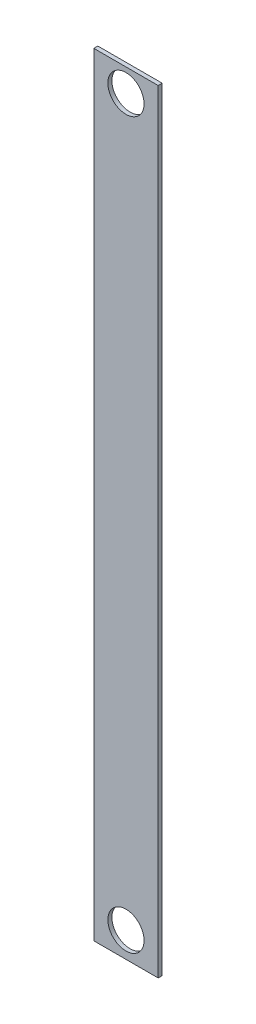
ISO-10303-21;
HEADER;
FILE_DESCRIPTION(('STEP AP214'),'2;1');
FILE_NAME('part.step','',(''),(''),'','','');
FILE_SCHEMA(('AUTOMOTIVE_DESIGN { 1 0 10303 214 1 1 1 1 }'));
ENDSEC;
DATA;
#1=APPLICATION_CONTEXT('core data for automotive mechanical design processes');
#2=APPLICATION_PROTOCOL_DEFINITION('international standard','automotive_design',2000,#1);
#3=PRODUCT_CONTEXT('',#1,'mechanical');
#4=PRODUCT('Part','Part','',(#3));
#5=PRODUCT_RELATED_PRODUCT_CATEGORY('part','',(#4));
#6=PRODUCT_DEFINITION_FORMATION('','',#4);
#7=PRODUCT_DEFINITION_CONTEXT('part definition',#1,'design');
#8=PRODUCT_DEFINITION('design','',#6,#7);
#9=PRODUCT_DEFINITION_SHAPE('','',#8);
#10=(LENGTH_UNIT() NAMED_UNIT(*) SI_UNIT(.MILLI.,.METRE.));
#11=(NAMED_UNIT(*) PLANE_ANGLE_UNIT() SI_UNIT($,.RADIAN.));
#12=(NAMED_UNIT(*) SI_UNIT($,.STERADIAN.) SOLID_ANGLE_UNIT());
#13=UNCERTAINTY_MEASURE_WITH_UNIT(LENGTH_MEASURE(1.E-05),#10,'distance_accuracy_value','');
#14=(GEOMETRIC_REPRESENTATION_CONTEXT(3) GLOBAL_UNCERTAINTY_ASSIGNED_CONTEXT((#13)) GLOBAL_UNIT_ASSIGNED_CONTEXT((#10,
#11,#12)) REPRESENTATION_CONTEXT('',''));
#15=CARTESIAN_POINT('',(0.,0.,0.));
#16=DIRECTION('',(0.,0.,1.));
#17=DIRECTION('',(1.,0.,0.));
#18=AXIS2_PLACEMENT_3D('',#15,#16,#17);
#19=CARTESIAN_POINT('',(0.,0.,3.175));
#20=DIRECTION('',(1.,0.,0.));
#21=DIRECTION('',(0.,1.,0.));
#22=AXIS2_PLACEMENT_3D('',#19,#20,#21);
#23=PLANE('',#22);
#24=DIRECTION('',(0.,-1.,0.));
#25=VECTOR('',#24,1.);
#26=CARTESIAN_POINT('',(0.,0.,0.));
#27=LINE('',#26,#25);
#28=CARTESIAN_POINT('',(0.,0.,0.));
#29=VERTEX_POINT('',#28);
#30=CARTESIAN_POINT('',(0.,-609.6,0.));
#31=VERTEX_POINT('',#30);
#32=EDGE_CURVE('E105',#29,#31,#27,.T.);
#33=ORIENTED_EDGE('',*,*,#32,.T.);
#34=DIRECTION('',(0.,0.,-1.));
#35=VECTOR('',#34,1.);
#36=CARTESIAN_POINT('',(0.,-609.6,3.175));
#37=LINE('',#36,#35);
#38=CARTESIAN_POINT('',(0.,-609.6,3.175));
#39=VERTEX_POINT('',#38);
#40=EDGE_CURVE('E11',#39,#31,#37,.T.);
#41=ORIENTED_EDGE('',*,*,#40,.F.);
#42=DIRECTION('',(0.,-1.,0.));
#43=VECTOR('',#42,1.);
#44=CARTESIAN_POINT('',(0.,0.,3.175));
#45=LINE('',#44,#43);
#46=CARTESIAN_POINT('',(0.,0.,3.175));
#47=VERTEX_POINT('',#46);
#48=EDGE_CURVE('E89',#47,#39,#45,.T.);
#49=ORIENTED_EDGE('',*,*,#48,.F.);
#50=DIRECTION('',(0.,0.,-1.));
#51=VECTOR('',#50,1.);
#52=CARTESIAN_POINT('',(0.,0.,3.175));
#53=LINE('',#52,#51);
#54=EDGE_CURVE('E98',#47,#29,#53,.T.);
#55=ORIENTED_EDGE('',*,*,#54,.T.);
#56=EDGE_LOOP('',(#33,#41,#49,#55));
#57=FACE_BOUND('',#56,.T.);
#58=ADVANCED_FACE('F39',(#57),#23,.F.);
#59=CARTESIAN_POINT('',(0.,-609.6,3.175));
#60=DIRECTION('',(0.,1.,0.));
#61=DIRECTION('',(0.,0.,1.));
#62=AXIS2_PLACEMENT_3D('',#59,#60,#61);
#63=PLANE('',#62);
#64=DIRECTION('',(1.,0.,0.));
#65=VECTOR('',#64,1.);
#66=CARTESIAN_POINT('',(0.,-609.6,0.));
#67=LINE('',#66,#65);
#68=CARTESIAN_POINT('',(50.8000000000001,-609.6,0.));
#69=VERTEX_POINT('',#68);
#70=EDGE_CURVE('E94',#31,#69,#67,.T.);
#71=ORIENTED_EDGE('',*,*,#70,.T.);
#72=DIRECTION('',(0.,0.,-1.));
#73=VECTOR('',#72,1.);
#74=CARTESIAN_POINT('',(50.8000000000001,-609.6,3.175));
#75=LINE('',#74,#73);
#76=CARTESIAN_POINT('',(50.8000000000001,-609.6,3.175));
#77=VERTEX_POINT('',#76);
#78=EDGE_CURVE('E50',#77,#69,#75,.T.);
#79=ORIENTED_EDGE('',*,*,#78,.F.);
#80=DIRECTION('',(1.,0.,0.));
#81=VECTOR('',#80,1.);
#82=CARTESIAN_POINT('',(0.,-609.6,3.175));
#83=LINE('',#82,#81);
#84=EDGE_CURVE('E83',#39,#77,#83,.T.);
#85=ORIENTED_EDGE('',*,*,#84,.F.);
#86=ORIENTED_EDGE('',*,*,#40,.T.);
#87=EDGE_LOOP('',(#71,#79,#85,#86));
#88=FACE_BOUND('',#87,.T.);
#89=ADVANCED_FACE('F91',(#88),#63,.F.);
#90=CARTESIAN_POINT('',(50.8,0.,3.175));
#91=DIRECTION('',(-1.,0.,0.));
#92=DIRECTION('',(0.,-1.,0.));
#93=AXIS2_PLACEMENT_3D('',#90,#91,#92);
#94=PLANE('',#93);
#95=DIRECTION('',(0.,1.,0.));
#96=VECTOR('',#95,1.);
#97=CARTESIAN_POINT('',(50.8,0.,0.));
#98=LINE('',#97,#96);
#99=CARTESIAN_POINT('',(50.8,0.,0.));
#100=VERTEX_POINT('',#99);
#101=EDGE_CURVE('E75',#69,#100,#98,.T.);
#102=ORIENTED_EDGE('',*,*,#101,.T.);
#103=DIRECTION('',(0.,0.,-1.));
#104=VECTOR('',#103,1.);
#105=CARTESIAN_POINT('',(50.8,0.,3.175));
#106=LINE('',#105,#104);
#107=CARTESIAN_POINT('',(50.8,0.,3.175));
#108=VERTEX_POINT('',#107);
#109=EDGE_CURVE('E92',#108,#100,#106,.T.);
#110=ORIENTED_EDGE('',*,*,#109,.F.);
#111=DIRECTION('',(0.,1.,0.));
#112=VECTOR('',#111,1.);
#113=CARTESIAN_POINT('',(50.8,0.,3.175));
#114=LINE('',#113,#112);
#115=EDGE_CURVE('E86',#77,#108,#114,.T.);
#116=ORIENTED_EDGE('',*,*,#115,.F.);
#117=ORIENTED_EDGE('',*,*,#78,.T.);
#118=EDGE_LOOP('',(#102,#110,#116,#117));
#119=FACE_BOUND('',#118,.T.);
#120=ADVANCED_FACE('F96',(#119),#94,.F.);
#121=CARTESIAN_POINT('',(0.,0.,3.175));
#122=DIRECTION('',(0.,-1.,0.));
#123=DIRECTION('',(0.,0.,-1.));
#124=AXIS2_PLACEMENT_3D('',#121,#122,#123);
#125=PLANE('',#124);
#126=DIRECTION('',(-1.,0.,0.));
#127=VECTOR('',#126,1.);
#128=CARTESIAN_POINT('',(0.,0.,0.));
#129=LINE('',#128,#127);
#130=EDGE_CURVE('E77',#100,#29,#129,.T.);
#131=ORIENTED_EDGE('',*,*,#130,.T.);
#132=ORIENTED_EDGE('',*,*,#54,.F.);
#133=DIRECTION('',(-1.,0.,0.));
#134=VECTOR('',#133,1.);
#135=CARTESIAN_POINT('',(0.,0.,3.175));
#136=LINE('',#135,#134);
#137=EDGE_CURVE('E54',#108,#47,#136,.T.);
#138=ORIENTED_EDGE('',*,*,#137,.F.);
#139=ORIENTED_EDGE('',*,*,#109,.T.);
#140=EDGE_LOOP('',(#131,#132,#138,#139));
#141=FACE_BOUND('',#140,.T.);
#142=ADVANCED_FACE('F109',(#141),#125,.F.);
#143=CARTESIAN_POINT('',(0.,0.,3.175));
#144=DIRECTION('',(0.,0.,1.));
#145=DIRECTION('',(1.,0.,0.));
#146=AXIS2_PLACEMENT_3D('',#143,#144,#145);
#147=PLANE('',#146);
#148=CARTESIAN_POINT('',(25.4,-18.1413640627852,3.175));
#149=DIRECTION('',(0.,0.,1.));
#150=DIRECTION('',(1.,0.,0.));
#151=AXIS2_PLACEMENT_3D('',#148,#149,#150);
#152=CIRCLE('',#151,14.279);
#153=CARTESIAN_POINT('',(39.679,-18.1413640627852,3.175));
#154=VERTEX_POINT('',#153);
#155=EDGE_CURVE('E124',#154,#154,#152,.T.);
#156=ORIENTED_EDGE('',*,*,#155,.F.);
#157=EDGE_LOOP('',(#156));
#158=FACE_BOUND('',#157,.T.);
#159=CARTESIAN_POINT('',(25.4,-589.6,3.175));
#160=DIRECTION('',(0.,0.,1.));
#161=DIRECTION('',(1.,0.,0.));
#162=AXIS2_PLACEMENT_3D('',#159,#160,#161);
#163=CIRCLE('',#162,14.279);
#164=CARTESIAN_POINT('',(39.679,-589.6,3.175));
#165=VERTEX_POINT('',#164);
#166=EDGE_CURVE('E120',#165,#165,#163,.T.);
#167=ORIENTED_EDGE('',*,*,#166,.F.);
#168=EDGE_LOOP('',(#167));
#169=FACE_BOUND('',#168,.T.);
#170=ORIENTED_EDGE('',*,*,#48,.T.);
#171=ORIENTED_EDGE('',*,*,#84,.T.);
#172=ORIENTED_EDGE('',*,*,#115,.T.);
#173=ORIENTED_EDGE('',*,*,#137,.T.);
#174=EDGE_LOOP('',(#170,#171,#172,#173));
#175=FACE_BOUND('',#174,.T.);
#176=ADVANCED_FACE('F88',(#158,#169,#175),#147,.T.);
#177=CARTESIAN_POINT('',(0.,0.,0.));
#178=DIRECTION('',(0.,0.,1.));
#179=DIRECTION('',(1.,0.,0.));
#180=AXIS2_PLACEMENT_3D('',#177,#178,#179);
#181=PLANE('',#180);
#182=CARTESIAN_POINT('',(25.4,-18.1413640627852,0.));
#183=DIRECTION('',(0.,0.,1.));
#184=DIRECTION('',(1.,0.,0.));
#185=AXIS2_PLACEMENT_3D('',#182,#183,#184);
#186=CIRCLE('',#185,14.279);
#187=CARTESIAN_POINT('',(39.679,-18.1413640627852,0.));
#188=VERTEX_POINT('',#187);
#189=EDGE_CURVE('E104',#188,#188,#186,.T.);
#190=ORIENTED_EDGE('',*,*,#189,.T.);
#191=EDGE_LOOP('',(#190));
#192=FACE_BOUND('',#191,.T.);
#193=CARTESIAN_POINT('',(25.4,-589.6,0.));
#194=DIRECTION('',(0.,0.,1.));
#195=DIRECTION('',(1.,0.,0.));
#196=AXIS2_PLACEMENT_3D('',#193,#194,#195);
#197=CIRCLE('',#196,14.279);
#198=CARTESIAN_POINT('',(39.679,-589.6,0.));
#199=VERTEX_POINT('',#198);
#200=EDGE_CURVE('E118',#199,#199,#197,.T.);
#201=ORIENTED_EDGE('',*,*,#200,.T.);
#202=EDGE_LOOP('',(#201));
#203=FACE_BOUND('',#202,.T.);
#204=ORIENTED_EDGE('',*,*,#32,.F.);
#205=ORIENTED_EDGE('',*,*,#130,.F.);
#206=ORIENTED_EDGE('',*,*,#101,.F.);
#207=ORIENTED_EDGE('',*,*,#70,.F.);
#208=EDGE_LOOP('',(#204,#205,#206,#207));
#209=FACE_BOUND('',#208,.T.);
#210=ADVANCED_FACE('F114',(#192,#203,#209),#181,.F.);
#211=CARTESIAN_POINT('',(25.4,-589.6,0.));
#212=DIRECTION('',(0.,0.,1.));
#213=DIRECTION('',(1.,0.,0.));
#214=AXIS2_PLACEMENT_3D('',#211,#212,#213);
#215=CYLINDRICAL_SURFACE('',#214,14.279);
#216=ORIENTED_EDGE('',*,*,#200,.F.);
#217=EDGE_LOOP('',(#216));
#218=FACE_BOUND('',#217,.T.);
#219=ORIENTED_EDGE('',*,*,#166,.T.);
#220=EDGE_LOOP('',(#219));
#221=FACE_BOUND('',#220,.T.);
#222=ADVANCED_FACE('F132',(#218,#221),#215,.F.);
#223=CARTESIAN_POINT('',(25.4,-18.1413640627852,0.));
#224=DIRECTION('',(0.,0.,1.));
#225=DIRECTION('',(1.,0.,0.));
#226=AXIS2_PLACEMENT_3D('',#223,#224,#225);
#227=CYLINDRICAL_SURFACE('',#226,14.279);
#228=ORIENTED_EDGE('',*,*,#189,.F.);
#229=EDGE_LOOP('',(#228));
#230=FACE_BOUND('',#229,.T.);
#231=ORIENTED_EDGE('',*,*,#155,.T.);
#232=EDGE_LOOP('',(#231));
#233=FACE_BOUND('',#232,.T.);
#234=ADVANCED_FACE('F128',(#230,#233),#227,.F.);
#235=CLOSED_SHELL('',(#58,#89,#120,#142,#176,#210,#222,#234));
#236=MANIFOLD_SOLID_BREP('B2',#235);
#237=ADVANCED_BREP_SHAPE_REPRESENTATION('',(#18,#236),#14);
#238=SHAPE_DEFINITION_REPRESENTATION(#9,#237);
ENDSEC;
END-ISO-10303-21;
